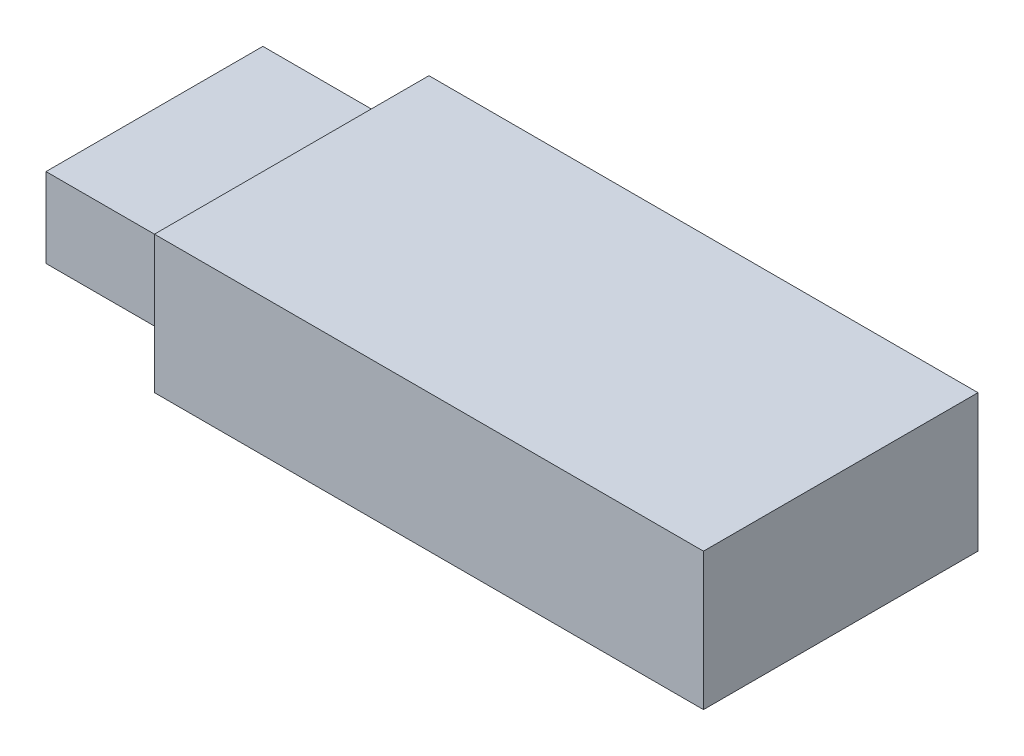
ISO-10303-21;
HEADER;
FILE_DESCRIPTION(('STEP AP214'),'2;1');
FILE_NAME('part.step','',(''),(''),'','','');
FILE_SCHEMA(('AUTOMOTIVE_DESIGN { 1 0 10303 214 1 1 1 1 }'));
ENDSEC;
DATA;
#1=APPLICATION_CONTEXT('core data for automotive mechanical design processes');
#2=APPLICATION_PROTOCOL_DEFINITION('international standard','automotive_design',2000,#1);
#3=PRODUCT_CONTEXT('',#1,'mechanical');
#4=PRODUCT('Part','Part','',(#3));
#5=PRODUCT_RELATED_PRODUCT_CATEGORY('part','',(#4));
#6=PRODUCT_DEFINITION_FORMATION('','',#4);
#7=PRODUCT_DEFINITION_CONTEXT('part definition',#1,'design');
#8=PRODUCT_DEFINITION('design','',#6,#7);
#9=PRODUCT_DEFINITION_SHAPE('','',#8);
#10=(LENGTH_UNIT() NAMED_UNIT(*) SI_UNIT(.MILLI.,.METRE.));
#11=(NAMED_UNIT(*) PLANE_ANGLE_UNIT() SI_UNIT($,.RADIAN.));
#12=(NAMED_UNIT(*) SI_UNIT($,.STERADIAN.) SOLID_ANGLE_UNIT());
#13=UNCERTAINTY_MEASURE_WITH_UNIT(LENGTH_MEASURE(1.E-05),#10,'distance_accuracy_value','');
#14=(GEOMETRIC_REPRESENTATION_CONTEXT(3) GLOBAL_UNCERTAINTY_ASSIGNED_CONTEXT((#13)) GLOBAL_UNIT_ASSIGNED_CONTEXT((#10,
#11,#12)) REPRESENTATION_CONTEXT('',''));
#15=CARTESIAN_POINT('',(0.,0.,0.));
#16=DIRECTION('',(0.,0.,1.));
#17=DIRECTION('',(1.,0.,0.));
#18=AXIS2_PLACEMENT_3D('',#15,#16,#17);
#19=CARTESIAN_POINT('',(0.,20.,0.));
#20=DIRECTION('',(0.,0.,-1.));
#21=DIRECTION('',(-1.,0.,0.));
#22=AXIS2_PLACEMENT_3D('',#19,#20,#21);
#23=PLANE('',#22);
#24=DIRECTION('',(0.,1.,0.));
#25=VECTOR('',#24,1.);
#26=CARTESIAN_POINT('',(20.,0.,0.));
#27=LINE('',#26,#25);
#28=CARTESIAN_POINT('',(20.,0.,0.));
#29=VERTEX_POINT('',#28);
#30=CARTESIAN_POINT('',(20.,20.,0.));
#31=VERTEX_POINT('',#30);
#32=EDGE_CURVE('E138',#29,#31,#27,.T.);
#33=ORIENTED_EDGE('',*,*,#32,.F.);
#34=DIRECTION('',(1.,0.,0.));
#35=VECTOR('',#34,1.);
#36=CARTESIAN_POINT('',(0.,0.,0.));
#37=LINE('',#36,#35);
#38=CARTESIAN_POINT('',(100.,0.,0.));
#39=VERTEX_POINT('',#38);
#40=EDGE_CURVE('E143',#29,#39,#37,.T.);
#41=ORIENTED_EDGE('',*,*,#40,.T.);
#42=DIRECTION('',(0.,-1.,0.));
#43=VECTOR('',#42,1.);
#44=CARTESIAN_POINT('',(100.,20.,0.));
#45=LINE('',#44,#43);
#46=CARTESIAN_POINT('',(100.,20.,0.));
#47=VERTEX_POINT('',#46);
#48=EDGE_CURVE('E11',#47,#39,#45,.T.);
#49=ORIENTED_EDGE('',*,*,#48,.F.);
#50=DIRECTION('',(1.,0.,0.));
#51=VECTOR('',#50,1.);
#52=CARTESIAN_POINT('',(0.,20.,0.));
#53=LINE('',#52,#51);
#54=EDGE_CURVE('E144',#31,#47,#53,.T.);
#55=ORIENTED_EDGE('',*,*,#54,.F.);
#56=EDGE_LOOP('',(#33,#41,#49,#55));
#57=FACE_BOUND('',#56,.T.);
#58=ADVANCED_FACE('F34',(#57),#23,.F.);
#59=CARTESIAN_POINT('',(0.,20.,-40.));
#60=DIRECTION('',(0.,0.,-1.));
#61=DIRECTION('',(-1.,0.,0.));
#62=AXIS2_PLACEMENT_3D('',#59,#60,#61);
#63=PLANE('',#62);
#64=DIRECTION('',(1.,0.,0.));
#65=VECTOR('',#64,1.);
#66=CARTESIAN_POINT('',(0.,0.,-40.));
#67=LINE('',#66,#65);
#68=CARTESIAN_POINT('',(20.,0.,-40.));
#69=VERTEX_POINT('',#68);
#70=CARTESIAN_POINT('',(100.,0.,-40.));
#71=VERTEX_POINT('',#70);
#72=EDGE_CURVE('E147',#69,#71,#67,.T.);
#73=ORIENTED_EDGE('',*,*,#72,.F.);
#74=DIRECTION('',(0.,-1.,0.));
#75=VECTOR('',#74,1.);
#76=CARTESIAN_POINT('',(20.,0.,-40.));
#77=LINE('',#76,#75);
#78=CARTESIAN_POINT('',(20.,20.,-40.));
#79=VERTEX_POINT('',#78);
#80=EDGE_CURVE('E56',#79,#69,#77,.T.);
#81=ORIENTED_EDGE('',*,*,#80,.F.);
#82=DIRECTION('',(1.,0.,0.));
#83=VECTOR('',#82,1.);
#84=CARTESIAN_POINT('',(0.,20.,-40.));
#85=LINE('',#84,#83);
#86=CARTESIAN_POINT('',(100.,20.,-40.));
#87=VERTEX_POINT('',#86);
#88=EDGE_CURVE('E150',#79,#87,#85,.T.);
#89=ORIENTED_EDGE('',*,*,#88,.T.);
#90=DIRECTION('',(0.,-1.,0.));
#91=VECTOR('',#90,1.);
#92=CARTESIAN_POINT('',(100.,20.,-40.));
#93=LINE('',#92,#91);
#94=EDGE_CURVE('E41',#87,#71,#93,.T.);
#95=ORIENTED_EDGE('',*,*,#94,.T.);
#96=EDGE_LOOP('',(#73,#81,#89,#95));
#97=FACE_BOUND('',#96,.T.);
#98=ADVANCED_FACE('F160',(#97),#63,.T.);
#99=CARTESIAN_POINT('',(0.,20.,0.));
#100=DIRECTION('',(0.,1.,0.));
#101=DIRECTION('',(0.,0.,1.));
#102=AXIS2_PLACEMENT_3D('',#99,#100,#101);
#103=PLANE('',#102);
#104=ORIENTED_EDGE('',*,*,#88,.F.);
#105=DIRECTION('',(0.,0.,-1.));
#106=VECTOR('',#105,1.);
#107=CARTESIAN_POINT('',(20.,20.,0.));
#108=LINE('',#107,#106);
#109=EDGE_CURVE('E140',#31,#79,#108,.T.);
#110=ORIENTED_EDGE('',*,*,#109,.F.);
#111=ORIENTED_EDGE('',*,*,#54,.T.);
#112=DIRECTION('',(0.,0.,-1.));
#113=VECTOR('',#112,1.);
#114=CARTESIAN_POINT('',(100.,20.,0.));
#115=LINE('',#114,#113);
#116=EDGE_CURVE('E146',#47,#87,#115,.T.);
#117=ORIENTED_EDGE('',*,*,#116,.T.);
#118=EDGE_LOOP('',(#104,#110,#111,#117));
#119=FACE_BOUND('',#118,.T.);
#120=ADVANCED_FACE('F175',(#119),#103,.T.);
#121=CARTESIAN_POINT('',(0.,0.,0.));
#122=DIRECTION('',(0.,1.,0.));
#123=DIRECTION('',(0.,0.,1.));
#124=AXIS2_PLACEMENT_3D('',#121,#122,#123);
#125=PLANE('',#124);
#126=DIRECTION('',(0.,0.,1.));
#127=VECTOR('',#126,1.);
#128=CARTESIAN_POINT('',(20.,0.,0.));
#129=LINE('',#128,#127);
#130=EDGE_CURVE('E133',#69,#29,#129,.T.);
#131=ORIENTED_EDGE('',*,*,#130,.F.);
#132=ORIENTED_EDGE('',*,*,#72,.T.);
#133=DIRECTION('',(0.,0.,-1.));
#134=VECTOR('',#133,1.);
#135=CARTESIAN_POINT('',(100.,0.,0.));
#136=LINE('',#135,#134);
#137=EDGE_CURVE('E153',#39,#71,#136,.T.);
#138=ORIENTED_EDGE('',*,*,#137,.F.);
#139=ORIENTED_EDGE('',*,*,#40,.F.);
#140=EDGE_LOOP('',(#131,#132,#138,#139));
#141=FACE_BOUND('',#140,.T.);
#142=ADVANCED_FACE('F169',(#141),#125,.F.);
#143=CARTESIAN_POINT('',(100.,20.,0.));
#144=DIRECTION('',(-1.,0.,0.));
#145=DIRECTION('',(0.,0.,1.));
#146=AXIS2_PLACEMENT_3D('',#143,#144,#145);
#147=PLANE('',#146);
#148=ORIENTED_EDGE('',*,*,#137,.T.);
#149=ORIENTED_EDGE('',*,*,#94,.F.);
#150=ORIENTED_EDGE('',*,*,#116,.F.);
#151=ORIENTED_EDGE('',*,*,#48,.T.);
#152=EDGE_LOOP('',(#148,#149,#150,#151));
#153=FACE_BOUND('',#152,.T.);
#154=ADVANCED_FACE('F165',(#153),#147,.F.);
#155=CARTESIAN_POINT('',(20.,0.,0.));
#156=DIRECTION('',(-1.,0.,0.));
#157=DIRECTION('',(0.,0.,1.));
#158=AXIS2_PLACEMENT_3D('',#155,#156,#157);
#159=PLANE('',#158);
#160=ORIENTED_EDGE('',*,*,#130,.T.);
#161=ORIENTED_EDGE('',*,*,#32,.T.);
#162=ORIENTED_EDGE('',*,*,#109,.T.);
#163=ORIENTED_EDGE('',*,*,#80,.T.);
#164=EDGE_LOOP('',(#160,#161,#162,#163));
#165=FACE_BOUND('',#164,.T.);
#166=DIRECTION('',(0.,0.,1.));
#167=VECTOR('',#166,1.);
#168=CARTESIAN_POINT('',(20.,4.2,0.));
#169=LINE('',#168,#167);
#170=CARTESIAN_POINT('',(20.,4.2,-35.8));
#171=VERTEX_POINT('',#170);
#172=CARTESIAN_POINT('',(20.,4.2,-4.20000000000001));
#173=VERTEX_POINT('',#172);
#174=EDGE_CURVE('E109',#171,#173,#169,.T.);
#175=ORIENTED_EDGE('',*,*,#174,.F.);
#176=DIRECTION('',(0.,-1.,0.));
#177=VECTOR('',#176,1.);
#178=CARTESIAN_POINT('',(20.,0.,-35.8));
#179=LINE('',#178,#177);
#180=CARTESIAN_POINT('',(20.,15.8,-35.8));
#181=VERTEX_POINT('',#180);
#182=EDGE_CURVE('E98',#181,#171,#179,.T.);
#183=ORIENTED_EDGE('',*,*,#182,.F.);
#184=DIRECTION('',(0.,0.,1.));
#185=VECTOR('',#184,1.);
#186=CARTESIAN_POINT('',(20.,15.8,0.));
#187=LINE('',#186,#185);
#188=CARTESIAN_POINT('',(20.,15.8,-4.20000000000001));
#189=VERTEX_POINT('',#188);
#190=EDGE_CURVE('E108',#181,#189,#187,.T.);
#191=ORIENTED_EDGE('',*,*,#190,.T.);
#192=DIRECTION('',(0.,-1.,0.));
#193=VECTOR('',#192,1.);
#194=CARTESIAN_POINT('',(20.,0.,-4.20000000000001));
#195=LINE('',#194,#193);
#196=EDGE_CURVE('E113',#189,#173,#195,.T.);
#197=ORIENTED_EDGE('',*,*,#196,.T.);
#198=EDGE_LOOP('',(#175,#183,#191,#197));
#199=FACE_BOUND('',#198,.T.);
#200=ADVANCED_FACE('F116',(#165,#199),#159,.T.);
#201=CARTESIAN_POINT('',(20.,4.2,0.));
#202=DIRECTION('',(0.,-1.,0.));
#203=DIRECTION('',(0.,0.,-1.));
#204=AXIS2_PLACEMENT_3D('',#201,#202,#203);
#205=PLANE('',#204);
#206=DIRECTION('',(0.,0.,1.));
#207=VECTOR('',#206,1.);
#208=CARTESIAN_POINT('',(0.,4.2,0.));
#209=LINE('',#208,#207);
#210=CARTESIAN_POINT('',(0.,4.2,-35.8));
#211=VERTEX_POINT('',#210);
#212=CARTESIAN_POINT('',(0.,4.2,-4.20000000000001));
#213=VERTEX_POINT('',#212);
#214=EDGE_CURVE('E48',#211,#213,#209,.T.);
#215=ORIENTED_EDGE('',*,*,#214,.F.);
#216=DIRECTION('',(-1.,0.,0.));
#217=VECTOR('',#216,1.);
#218=CARTESIAN_POINT('',(20.,4.2,-35.8));
#219=LINE('',#218,#217);
#220=EDGE_CURVE('E101',#171,#211,#219,.T.);
#221=ORIENTED_EDGE('',*,*,#220,.F.);
#222=ORIENTED_EDGE('',*,*,#174,.T.);
#223=DIRECTION('',(-1.,0.,0.));
#224=VECTOR('',#223,1.);
#225=CARTESIAN_POINT('',(20.,4.2,-4.20000000000001));
#226=LINE('',#225,#224);
#227=EDGE_CURVE('E131',#173,#213,#226,.T.);
#228=ORIENTED_EDGE('',*,*,#227,.T.);
#229=EDGE_LOOP('',(#215,#221,#222,#228));
#230=FACE_BOUND('',#229,.T.);
#231=ADVANCED_FACE('F111',(#230),#205,.T.);
#232=CARTESIAN_POINT('',(20.,0.,-4.20000000000001));
#233=DIRECTION('',(0.,0.,-1.));
#234=DIRECTION('',(-1.,0.,0.));
#235=AXIS2_PLACEMENT_3D('',#232,#233,#234);
#236=PLANE('',#235);
#237=DIRECTION('',(0.,-1.,0.));
#238=VECTOR('',#237,1.);
#239=CARTESIAN_POINT('',(0.,0.,-4.20000000000001));
#240=LINE('',#239,#238);
#241=CARTESIAN_POINT('',(0.,15.8,-4.20000000000001));
#242=VERTEX_POINT('',#241);
#243=EDGE_CURVE('E118',#242,#213,#240,.T.);
#244=ORIENTED_EDGE('',*,*,#243,.T.);
#245=ORIENTED_EDGE('',*,*,#227,.F.);
#246=ORIENTED_EDGE('',*,*,#196,.F.);
#247=DIRECTION('',(-1.,0.,0.));
#248=VECTOR('',#247,1.);
#249=CARTESIAN_POINT('',(20.,15.8,-4.20000000000001));
#250=LINE('',#249,#248);
#251=EDGE_CURVE('E134',#189,#242,#250,.T.);
#252=ORIENTED_EDGE('',*,*,#251,.T.);
#253=EDGE_LOOP('',(#244,#245,#246,#252));
#254=FACE_BOUND('',#253,.T.);
#255=ADVANCED_FACE('F222',(#254),#236,.F.);
#256=CARTESIAN_POINT('',(20.,15.8,0.));
#257=DIRECTION('',(0.,-1.,0.));
#258=DIRECTION('',(0.,0.,-1.));
#259=AXIS2_PLACEMENT_3D('',#256,#257,#258);
#260=PLANE('',#259);
#261=DIRECTION('',(0.,0.,1.));
#262=VECTOR('',#261,1.);
#263=CARTESIAN_POINT('',(0.,15.8,0.));
#264=LINE('',#263,#262);
#265=CARTESIAN_POINT('',(0.,15.8,-35.8));
#266=VERTEX_POINT('',#265);
#267=EDGE_CURVE('E121',#266,#242,#264,.T.);
#268=ORIENTED_EDGE('',*,*,#267,.T.);
#269=ORIENTED_EDGE('',*,*,#251,.F.);
#270=ORIENTED_EDGE('',*,*,#190,.F.);
#271=DIRECTION('',(-1.,0.,0.));
#272=VECTOR('',#271,1.);
#273=CARTESIAN_POINT('',(20.,15.8,-35.8));
#274=LINE('',#273,#272);
#275=EDGE_CURVE('E103',#181,#266,#274,.T.);
#276=ORIENTED_EDGE('',*,*,#275,.T.);
#277=EDGE_LOOP('',(#268,#269,#270,#276));
#278=FACE_BOUND('',#277,.T.);
#279=ADVANCED_FACE('F231',(#278),#260,.F.);
#280=CARTESIAN_POINT('',(20.,0.,-35.8));
#281=DIRECTION('',(0.,0.,-1.));
#282=DIRECTION('',(-1.,0.,0.));
#283=AXIS2_PLACEMENT_3D('',#280,#281,#282);
#284=PLANE('',#283);
#285=DIRECTION('',(0.,-1.,0.));
#286=VECTOR('',#285,1.);
#287=CARTESIAN_POINT('',(0.,0.,-35.8));
#288=LINE('',#287,#286);
#289=EDGE_CURVE('E127',#266,#211,#288,.T.);
#290=ORIENTED_EDGE('',*,*,#289,.F.);
#291=ORIENTED_EDGE('',*,*,#275,.F.);
#292=ORIENTED_EDGE('',*,*,#182,.T.);
#293=ORIENTED_EDGE('',*,*,#220,.T.);
#294=EDGE_LOOP('',(#290,#291,#292,#293));
#295=FACE_BOUND('',#294,.T.);
#296=ADVANCED_FACE('F100',(#295),#284,.T.);
#297=CARTESIAN_POINT('',(0.,20.,0.));
#298=DIRECTION('',(-1.,0.,0.));
#299=DIRECTION('',(0.,0.,1.));
#300=AXIS2_PLACEMENT_3D('',#297,#298,#299);
#301=PLANE('',#300);
#302=ORIENTED_EDGE('',*,*,#289,.T.);
#303=ORIENTED_EDGE('',*,*,#214,.T.);
#304=ORIENTED_EDGE('',*,*,#243,.F.);
#305=ORIENTED_EDGE('',*,*,#267,.F.);
#306=EDGE_LOOP('',(#302,#303,#304,#305));
#307=FACE_BOUND('',#306,.T.);
#308=ADVANCED_FACE('F250',(#307),#301,.T.);
#309=CLOSED_SHELL('',(#58,#98,#120,#142,#154,#200,#231,#255,#279,#296,#308));
#310=MANIFOLD_SOLID_BREP('B2',#309);
#311=ADVANCED_BREP_SHAPE_REPRESENTATION('',(#18,#310),#14);
#312=SHAPE_DEFINITION_REPRESENTATION(#9,#311);
ENDSEC;
END-ISO-10303-21;
